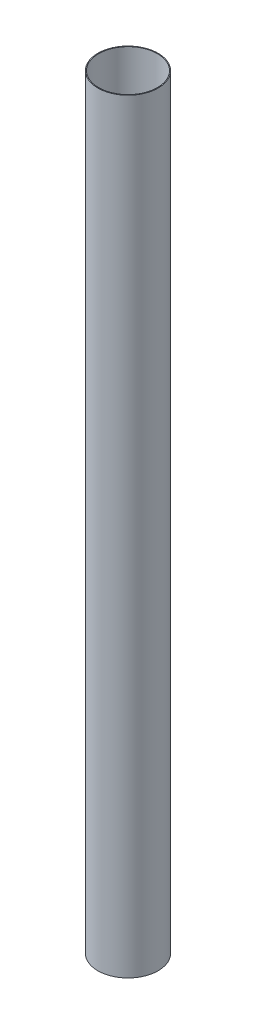
ISO-10303-21;
HEADER;
FILE_DESCRIPTION(('STEP AP214'),'2;1');
FILE_NAME('part.step','',(''),(''),'','','');
FILE_SCHEMA(('AUTOMOTIVE_DESIGN { 1 0 10303 214 1 1 1 1 }'));
ENDSEC;
DATA;
#1=APPLICATION_CONTEXT('core data for automotive mechanical design processes');
#2=APPLICATION_PROTOCOL_DEFINITION('international standard','automotive_design',2000,#1);
#3=PRODUCT_CONTEXT('',#1,'mechanical');
#4=PRODUCT('Part','Part','',(#3));
#5=PRODUCT_RELATED_PRODUCT_CATEGORY('part','',(#4));
#6=PRODUCT_DEFINITION_FORMATION('','',#4);
#7=PRODUCT_DEFINITION_CONTEXT('part definition',#1,'design');
#8=PRODUCT_DEFINITION('design','',#6,#7);
#9=PRODUCT_DEFINITION_SHAPE('','',#8);
#10=(LENGTH_UNIT() NAMED_UNIT(*) SI_UNIT(.MILLI.,.METRE.));
#11=(NAMED_UNIT(*) PLANE_ANGLE_UNIT() SI_UNIT($,.RADIAN.));
#12=(NAMED_UNIT(*) SI_UNIT($,.STERADIAN.) SOLID_ANGLE_UNIT());
#13=UNCERTAINTY_MEASURE_WITH_UNIT(LENGTH_MEASURE(1.E-05),#10,'distance_accuracy_value','');
#14=(GEOMETRIC_REPRESENTATION_CONTEXT(3) GLOBAL_UNCERTAINTY_ASSIGNED_CONTEXT((#13)) GLOBAL_UNIT_ASSIGNED_CONTEXT((#10,
#11,#12)) REPRESENTATION_CONTEXT('',''));
#15=CARTESIAN_POINT('',(0.,0.,0.));
#16=DIRECTION('',(0.,0.,1.));
#17=DIRECTION('',(1.,0.,0.));
#18=AXIS2_PLACEMENT_3D('',#15,#16,#17);
#19=CARTESIAN_POINT('',(0.,1651.,0.));
#20=DIRECTION('',(0.,1.,0.));
#21=DIRECTION('',(0.,0.,1.));
#22=AXIS2_PLACEMENT_3D('',#19,#20,#21);
#23=PLANE('',#22);
#24=CARTESIAN_POINT('',(0.,1651.,0.));
#25=DIRECTION('',(0.,1.,0.));
#26=DIRECTION('',(0.,0.,1.));
#27=AXIS2_PLACEMENT_3D('',#24,#25,#26);
#28=CIRCLE('',#27,65.151);
#29=CARTESIAN_POINT('',(0.,1651.,65.151));
#30=VERTEX_POINT('',#29);
#31=EDGE_CURVE('E10',#30,#30,#28,.T.);
#32=ORIENTED_EDGE('',*,*,#31,.T.);
#33=EDGE_LOOP('',(#32));
#34=FACE_BOUND('',#33,.T.);
#35=CARTESIAN_POINT('',(0.,1651.,0.));
#36=DIRECTION('',(0.,1.,0.));
#37=DIRECTION('',(0.,0.,1.));
#38=AXIS2_PLACEMENT_3D('',#35,#36,#37);
#39=CIRCLE('',#38,63.5);
#40=CARTESIAN_POINT('',(0.,1651.,63.5));
#41=VERTEX_POINT('',#40);
#42=EDGE_CURVE('E44',#41,#41,#39,.T.);
#43=ORIENTED_EDGE('',*,*,#42,.F.);
#44=EDGE_LOOP('',(#43));
#45=FACE_BOUND('',#44,.T.);
#46=ADVANCED_FACE('F33',(#34,#45),#23,.T.);
#47=CARTESIAN_POINT('',(0.,0.,0.));
#48=DIRECTION('',(0.,1.,0.));
#49=DIRECTION('',(0.,0.,1.));
#50=AXIS2_PLACEMENT_3D('',#47,#48,#49);
#51=PLANE('',#50);
#52=CARTESIAN_POINT('',(0.,0.,0.));
#53=DIRECTION('',(0.,1.,0.));
#54=DIRECTION('',(0.,0.,1.));
#55=AXIS2_PLACEMENT_3D('',#52,#53,#54);
#56=CIRCLE('',#55,65.151);
#57=CARTESIAN_POINT('',(0.,0.,65.151));
#58=VERTEX_POINT('',#57);
#59=EDGE_CURVE('E37',#58,#58,#56,.T.);
#60=ORIENTED_EDGE('',*,*,#59,.F.);
#61=EDGE_LOOP('',(#60));
#62=FACE_BOUND('',#61,.T.);
#63=CARTESIAN_POINT('',(0.,0.,0.));
#64=DIRECTION('',(0.,1.,0.));
#65=DIRECTION('',(0.,0.,1.));
#66=AXIS2_PLACEMENT_3D('',#63,#64,#65);
#67=CIRCLE('',#66,63.5);
#68=CARTESIAN_POINT('',(0.,0.,63.5));
#69=VERTEX_POINT('',#68);
#70=EDGE_CURVE('E46',#69,#69,#67,.T.);
#71=ORIENTED_EDGE('',*,*,#70,.T.);
#72=EDGE_LOOP('',(#71));
#73=FACE_BOUND('',#72,.T.);
#74=ADVANCED_FACE('F56',(#62,#73),#51,.F.);
#75=CARTESIAN_POINT('',(0.,1651.,0.));
#76=DIRECTION('',(0.,-1.,0.));
#77=DIRECTION('',(0.,0.,-1.));
#78=AXIS2_PLACEMENT_3D('',#75,#76,#77);
#79=CYLINDRICAL_SURFACE('',#78,65.151);
#80=ORIENTED_EDGE('',*,*,#31,.F.);
#81=EDGE_LOOP('',(#80));
#82=FACE_BOUND('',#81,.T.);
#83=ORIENTED_EDGE('',*,*,#59,.T.);
#84=EDGE_LOOP('',(#83));
#85=FACE_BOUND('',#84,.T.);
#86=ADVANCED_FACE('F35',(#82,#85),#79,.T.);
#87=CARTESIAN_POINT('',(0.,1651.,0.));
#88=DIRECTION('',(0.,-1.,0.));
#89=DIRECTION('',(0.,0.,-1.));
#90=AXIS2_PLACEMENT_3D('',#87,#88,#89);
#91=CYLINDRICAL_SURFACE('',#90,63.5);
#92=ORIENTED_EDGE('',*,*,#42,.T.);
#93=EDGE_LOOP('',(#92));
#94=FACE_BOUND('',#93,.T.);
#95=ORIENTED_EDGE('',*,*,#70,.F.);
#96=EDGE_LOOP('',(#95));
#97=FACE_BOUND('',#96,.T.);
#98=ADVANCED_FACE('F52',(#94,#97),#91,.F.);
#99=CLOSED_SHELL('',(#46,#74,#86,#98));
#100=MANIFOLD_SOLID_BREP('B2',#99);
#101=ADVANCED_BREP_SHAPE_REPRESENTATION('',(#18,#100),#14);
#102=SHAPE_DEFINITION_REPRESENTATION(#9,#101);
ENDSEC;
END-ISO-10303-21;
